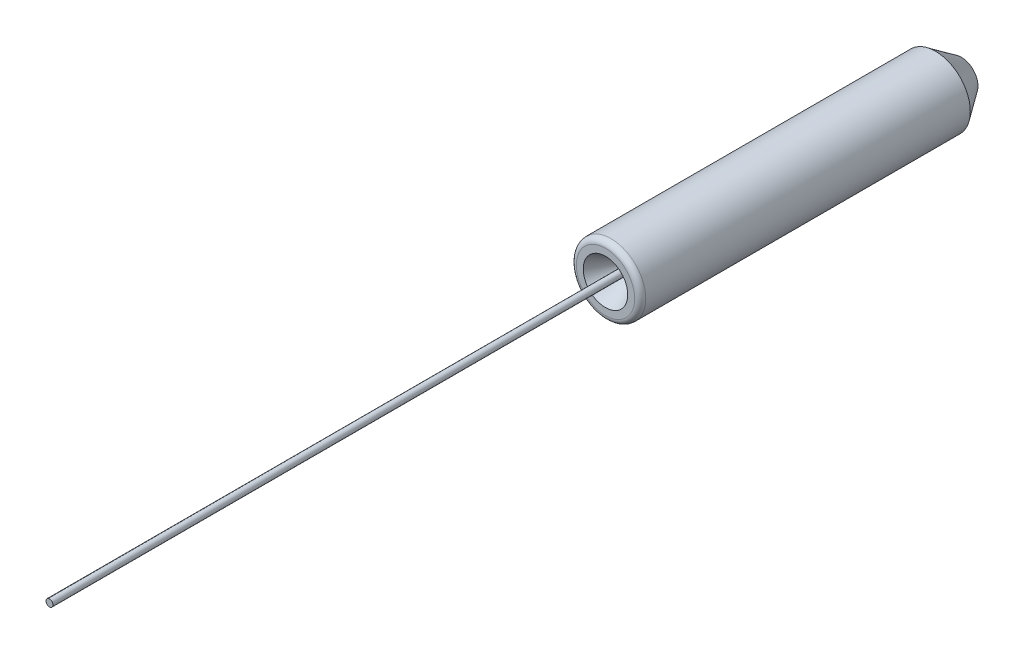
ISO-10303-21;
HEADER;
FILE_DESCRIPTION(('STEP AP214'),'2;1');
FILE_NAME('part.step','',(''),(''),'','','');
FILE_SCHEMA(('AUTOMOTIVE_DESIGN { 1 0 10303 214 1 1 1 1 }'));
ENDSEC;
DATA;
#1=APPLICATION_CONTEXT('core data for automotive mechanical design processes');
#2=APPLICATION_PROTOCOL_DEFINITION('international standard','automotive_design',2000,#1);
#3=PRODUCT_CONTEXT('',#1,'mechanical');
#4=PRODUCT('Part','Part','',(#3));
#5=PRODUCT_RELATED_PRODUCT_CATEGORY('part','',(#4));
#6=PRODUCT_DEFINITION_FORMATION('','',#4);
#7=PRODUCT_DEFINITION_CONTEXT('part definition',#1,'design');
#8=PRODUCT_DEFINITION('design','',#6,#7);
#9=PRODUCT_DEFINITION_SHAPE('','',#8);
#10=(LENGTH_UNIT() NAMED_UNIT(*) SI_UNIT(.MILLI.,.METRE.));
#11=(NAMED_UNIT(*) PLANE_ANGLE_UNIT() SI_UNIT($,.RADIAN.));
#12=(NAMED_UNIT(*) SI_UNIT($,.STERADIAN.) SOLID_ANGLE_UNIT());
#13=UNCERTAINTY_MEASURE_WITH_UNIT(LENGTH_MEASURE(1.E-05),#10,'distance_accuracy_value','');
#14=(GEOMETRIC_REPRESENTATION_CONTEXT(3) GLOBAL_UNCERTAINTY_ASSIGNED_CONTEXT((#13)) GLOBAL_UNIT_ASSIGNED_CONTEXT((#10,
#11,#12)) REPRESENTATION_CONTEXT('',''));
#15=CARTESIAN_POINT('',(0.,0.,0.));
#16=DIRECTION('',(0.,0.,1.));
#17=DIRECTION('',(1.,0.,0.));
#18=AXIS2_PLACEMENT_3D('',#15,#16,#17);
#19=CARTESIAN_POINT('',(0.,0.,-6.4));
#20=DIRECTION('',(0.,0.,1.));
#21=DIRECTION('',(1.,0.,0.));
#22=AXIS2_PLACEMENT_3D('',#19,#20,#21);
#23=CYLINDRICAL_SURFACE('',#22,0.0625);
#24=CARTESIAN_POINT('',(0.,0.,-6.4));
#25=DIRECTION('',(0.,0.,1.));
#26=DIRECTION('',(1.,0.,0.));
#27=AXIS2_PLACEMENT_3D('',#24,#25,#26);
#28=CIRCLE('',#27,0.0625);
#29=CARTESIAN_POINT('',(0.0625,0.,-6.4));
#30=VERTEX_POINT('',#29);
#31=EDGE_CURVE('P0_E10',#30,#30,#28,.T.);
#32=ORIENTED_EDGE('',*,*,#31,.T.);
#33=EDGE_LOOP('',(#32));
#34=FACE_BOUND('',#33,.T.);
#35=CARTESIAN_POINT('',(0.,0.,10.));
#36=DIRECTION('',(0.,0.,1.));
#37=DIRECTION('',(1.,0.,0.));
#38=AXIS2_PLACEMENT_3D('',#35,#36,#37);
#39=CIRCLE('',#38,0.0625);
#40=CARTESIAN_POINT('',(0.0625,0.,10.));
#41=VERTEX_POINT('',#40);
#42=EDGE_CURVE('P0_E17',#41,#41,#39,.T.);
#43=ORIENTED_EDGE('',*,*,#42,.F.);
#44=EDGE_LOOP('',(#43));
#45=FACE_BOUND('',#44,.T.);
#46=ADVANCED_FACE('P0_F14',(#34,#45),#23,.T.);
#47=CARTESIAN_POINT('',(0.,0.,-6.4));
#48=DIRECTION('',(0.,0.,1.));
#49=DIRECTION('',(1.,0.,0.));
#50=AXIS2_PLACEMENT_3D('',#47,#48,#49);
#51=PLANE('',#50);
#52=ORIENTED_EDGE('',*,*,#31,.F.);
#53=EDGE_LOOP('',(#52));
#54=FACE_BOUND('',#53,.T.);
#55=ADVANCED_FACE('P0_F29',(#54),#51,.F.);
#56=CARTESIAN_POINT('',(0.,0.,10.));
#57=DIRECTION('',(0.,0.,1.));
#58=DIRECTION('',(1.,0.,0.));
#59=AXIS2_PLACEMENT_3D('',#56,#57,#58);
#60=PLANE('',#59);
#61=ORIENTED_EDGE('',*,*,#42,.T.);
#62=EDGE_LOOP('',(#61));
#63=FACE_BOUND('',#62,.T.);
#64=ADVANCED_FACE('P0_F26',(#63),#60,.T.);
#65=CLOSED_SHELL('',(#46,#55,#64));
#66=MANIFOLD_SOLID_BREP('P0_B1',#65);
#67=CARTESIAN_POINT('',(0.,0.,-6.4));
#68=DIRECTION('',(0.,0.,1.));
#69=DIRECTION('',(1.,0.,0.));
#70=AXIS2_PLACEMENT_3D('',#67,#68,#69);
#71=CYLINDRICAL_SURFACE('',#70,0.6245);
#72=CARTESIAN_POINT('',(0.,0.,-0.1));
#73=DIRECTION('',(0.,0.,1.));
#74=DIRECTION('',(1.,0.,0.));
#75=AXIS2_PLACEMENT_3D('',#72,#73,#74);
#76=CIRCLE('',#75,0.6245);
#77=CARTESIAN_POINT('',(0.6245,0.,-0.1));
#78=VERTEX_POINT('',#77);
#79=EDGE_CURVE('P1_E9',#78,#78,#76,.F.);
#80=ORIENTED_EDGE('',*,*,#79,.T.);
#81=EDGE_LOOP('',(#80));
#82=FACE_BOUND('',#81,.T.);
#83=CARTESIAN_POINT('',(0.,0.,-5.93585189780881));
#84=DIRECTION('',(0.,0.,1.));
#85=DIRECTION('',(1.,0.,0.));
#86=AXIS2_PLACEMENT_3D('',#83,#84,#85);
#87=CIRCLE('',#86,0.6245);
#88=CARTESIAN_POINT('',(0.6245,0.,-5.93585189780881));
#89=VERTEX_POINT('',#88);
#90=EDGE_CURVE('P1_E28',#89,#89,#87,.T.);
#91=ORIENTED_EDGE('',*,*,#90,.T.);
#92=EDGE_LOOP('',(#91));
#93=FACE_BOUND('',#92,.T.);
#94=ADVANCED_FACE('P1_F13',(#82,#93),#71,.T.);
#95=CARTESIAN_POINT('',(0.,0.,-6.4));
#96=DIRECTION('',(0.,0.,1.));
#97=DIRECTION('',(1.,0.,0.));
#98=AXIS2_PLACEMENT_3D('',#95,#96,#97);
#99=PLANE('',#98);
#100=CARTESIAN_POINT('',(0.,0.,-6.4));
#101=DIRECTION('',(0.,0.,1.));
#102=DIRECTION('',(1.,0.,0.));
#103=AXIS2_PLACEMENT_3D('',#100,#101,#102);
#104=CIRCLE('',#103,0.299499999999999);
#105=CARTESIAN_POINT('',(0.299499999999999,0.,-6.4));
#106=VERTEX_POINT('',#105);
#107=EDGE_CURVE('P1_E24',#106,#106,#104,.F.);
#108=ORIENTED_EDGE('',*,*,#107,.T.);
#109=EDGE_LOOP('',(#108));
#110=FACE_BOUND('',#109,.T.);
#111=CARTESIAN_POINT('',(0.,0.,-6.4));
#112=DIRECTION('',(0.,0.,-1.));
#113=DIRECTION('',(-1.,0.,0.));
#114=AXIS2_PLACEMENT_3D('',#111,#112,#113);
#115=CIRCLE('',#114,0.063);
#116=CARTESIAN_POINT('',(-0.063,0.,-6.4));
#117=VERTEX_POINT('',#116);
#118=EDGE_CURVE('P1_E42',#117,#117,#115,.T.);
#119=ORIENTED_EDGE('',*,*,#118,.F.);
#120=EDGE_LOOP('',(#119));
#121=FACE_BOUND('',#120,.T.);
#122=ADVANCED_FACE('P1_F48',(#110,#121),#99,.F.);
#123=CARTESIAN_POINT('',(0.,0.,0.));
#124=DIRECTION('',(0.,0.,1.));
#125=DIRECTION('',(1.,0.,0.));
#126=AXIS2_PLACEMENT_3D('',#123,#124,#125);
#127=PLANE('',#126);
#128=CARTESIAN_POINT('',(0.,0.,0.));
#129=DIRECTION('',(0.,0.,1.));
#130=DIRECTION('',(1.,0.,0.));
#131=AXIS2_PLACEMENT_3D('',#128,#129,#130);
#132=CIRCLE('',#131,0.5245);
#133=CARTESIAN_POINT('',(0.5245,0.,0.));
#134=VERTEX_POINT('',#133);
#135=EDGE_CURVE('P1_E20',#134,#134,#132,.T.);
#136=ORIENTED_EDGE('',*,*,#135,.T.);
#137=EDGE_LOOP('',(#136));
#138=FACE_BOUND('',#137,.T.);
#139=CARTESIAN_POINT('',(0.,0.,0.));
#140=DIRECTION('',(0.,0.,-1.));
#141=DIRECTION('',(-1.,0.,0.));
#142=AXIS2_PLACEMENT_3D('',#139,#140,#141);
#143=CIRCLE('',#142,0.4);
#144=CARTESIAN_POINT('',(-0.4,0.,0.));
#145=VERTEX_POINT('',#144);
#146=EDGE_CURVE('P1_E33',#145,#145,#143,.T.);
#147=ORIENTED_EDGE('',*,*,#146,.T.);
#148=EDGE_LOOP('',(#147));
#149=FACE_BOUND('',#148,.T.);
#150=ADVANCED_FACE('P1_F50',(#138,#149),#127,.T.);
#151=CARTESIAN_POINT('',(0.,0.,-0.537290960636936));
#152=DIRECTION('',(0.,0.,1.));
#153=DIRECTION('',(1.,0.,0.));
#154=AXIS2_PLACEMENT_3D('',#151,#152,#153);
#155=CONICAL_SURFACE('',#154,0.0897949192431117,0.5235987755983);
#156=ORIENTED_EDGE('',*,*,#146,.F.);
#157=EDGE_LOOP('',(#156));
#158=FACE_BOUND('',#157,.T.);
#159=CARTESIAN_POINT('',(0.,0.,-0.537290960636936));
#160=DIRECTION('',(0.,0.,-1.));
#161=DIRECTION('',(-1.,0.,0.));
#162=AXIS2_PLACEMENT_3D('',#159,#160,#161);
#163=CIRCLE('',#162,0.0897949192431117);
#164=CARTESIAN_POINT('',(-0.0897949192431117,0.,-0.537290960636936));
#165=VERTEX_POINT('',#164);
#166=EDGE_CURVE('P1_E36',#165,#165,#163,.T.);
#167=ORIENTED_EDGE('',*,*,#166,.T.);
#168=EDGE_LOOP('',(#167));
#169=FACE_BOUND('',#168,.T.);
#170=ADVANCED_FACE('P1_F58',(#158,#169),#155,.F.);
#171=CARTESIAN_POINT('',(0.,0.,-0.637290960636936));
#172=DIRECTION('',(0.,0.,-1.));
#173=DIRECTION('',(-1.,0.,0.));
#174=AXIS2_PLACEMENT_3D('',#171,#172,#173);
#175=TOROIDAL_SURFACE('',#174,0.262999999999999,0.2);
#176=ORIENTED_EDGE('',*,*,#166,.F.);
#177=EDGE_LOOP('',(#176));
#178=FACE_BOUND('',#177,.T.);
#179=CARTESIAN_POINT('',(0.,0.,-0.637290960636937));
#180=DIRECTION('',(0.,0.,-1.));
#181=DIRECTION('',(-1.,0.,0.));
#182=AXIS2_PLACEMENT_3D('',#179,#180,#181);
#183=CIRCLE('',#182,0.0629999999999993);
#184=CARTESIAN_POINT('',(-0.0629999999999993,0.,-0.637290960636937));
#185=VERTEX_POINT('',#184);
#186=EDGE_CURVE('P1_E39',#185,#185,#183,.T.);
#187=ORIENTED_EDGE('',*,*,#186,.T.);
#188=EDGE_LOOP('',(#187));
#189=FACE_BOUND('',#188,.T.);
#190=ADVANCED_FACE('P1_F71',(#178,#189),#175,.T.);
#191=CARTESIAN_POINT('',(0.,0.,-13.136975719544));
#192=DIRECTION('',(0.,0.,-1.));
#193=DIRECTION('',(-1.,0.,0.));
#194=AXIS2_PLACEMENT_3D('',#191,#192,#193);
#195=CYLINDRICAL_SURFACE('',#194,0.0629999999999997);
#196=ORIENTED_EDGE('',*,*,#186,.F.);
#197=EDGE_LOOP('',(#196));
#198=FACE_BOUND('',#197,.T.);
#199=ORIENTED_EDGE('',*,*,#118,.T.);
#200=EDGE_LOOP('',(#199));
#201=FACE_BOUND('',#200,.T.);
#202=ADVANCED_FACE('P1_F46',(#198,#201),#195,.F.);
#203=CARTESIAN_POINT('',(0.,0.,-5.93585189780881));
#204=DIRECTION('',(0.,0.,1.));
#205=DIRECTION('',(1.,0.,0.));
#206=AXIS2_PLACEMENT_3D('',#203,#204,#205);
#207=CONICAL_SURFACE('',#206,0.6245,0.610865238198017);
#208=ORIENTED_EDGE('',*,*,#107,.F.);
#209=EDGE_LOOP('',(#208));
#210=FACE_BOUND('',#209,.T.);
#211=ORIENTED_EDGE('',*,*,#90,.F.);
#212=EDGE_LOOP('',(#211));
#213=FACE_BOUND('',#212,.T.);
#214=ADVANCED_FACE('P1_F63',(#210,#213),#207,.T.);
#215=CARTESIAN_POINT('',(0.,0.,-0.1));
#216=DIRECTION('',(0.,0.,1.));
#217=DIRECTION('',(1.,0.,0.));
#218=AXIS2_PLACEMENT_3D('',#215,#216,#217);
#219=TOROIDAL_SURFACE('',#218,0.5245,0.1);
#220=ORIENTED_EDGE('',*,*,#79,.F.);
#221=EDGE_LOOP('',(#220));
#222=FACE_BOUND('',#221,.T.);
#223=ORIENTED_EDGE('',*,*,#135,.F.);
#224=EDGE_LOOP('',(#223));
#225=FACE_BOUND('',#224,.T.);
#226=ADVANCED_FACE('P1_F15',(#222,#225),#219,.T.);
#227=CLOSED_SHELL('',(#94,#122,#150,#170,#190,#202,#214,#226));
#228=MANIFOLD_SOLID_BREP('P1_B1',#227);
#229=ADVANCED_BREP_SHAPE_REPRESENTATION('',(#18,#66,#228),#14);
#230=SHAPE_DEFINITION_REPRESENTATION(#9,#229);
ENDSEC;
END-ISO-10303-21;
